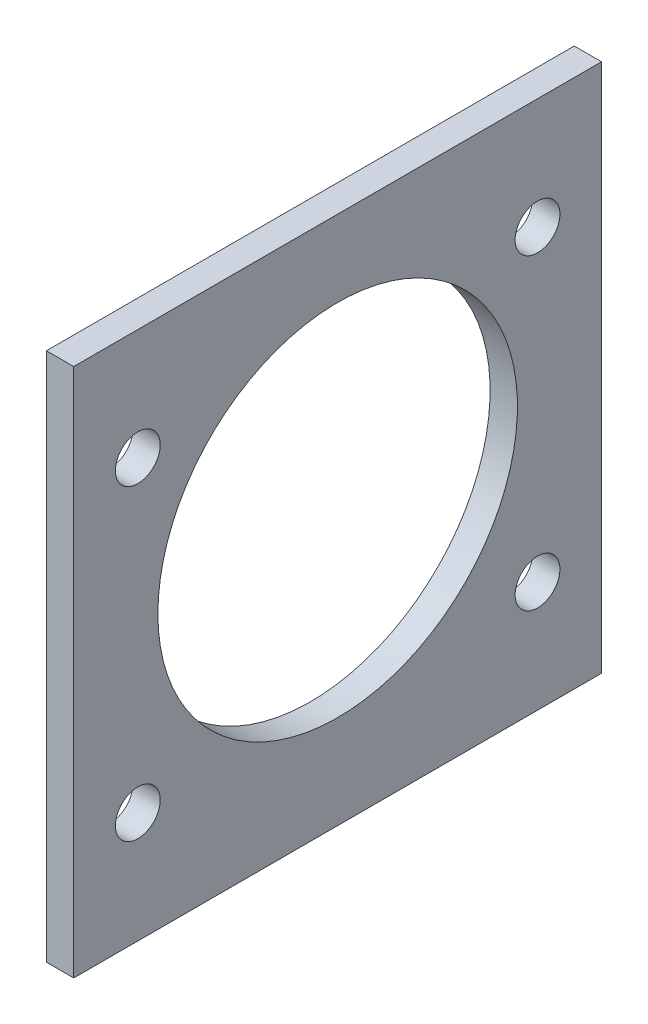
ISO-10303-21;
HEADER;
FILE_DESCRIPTION(('STEP AP214'),'2;1');
FILE_NAME('part.step','',(''),(''),'','','');
FILE_SCHEMA(('AUTOMOTIVE_DESIGN { 1 0 10303 214 1 1 1 1 }'));
ENDSEC;
DATA;
#1=APPLICATION_CONTEXT('core data for automotive mechanical design processes');
#2=APPLICATION_PROTOCOL_DEFINITION('international standard','automotive_design',2000,#1);
#3=PRODUCT_CONTEXT('',#1,'mechanical');
#4=PRODUCT('Part','Part','',(#3));
#5=PRODUCT_RELATED_PRODUCT_CATEGORY('part','',(#4));
#6=PRODUCT_DEFINITION_FORMATION('','',#4);
#7=PRODUCT_DEFINITION_CONTEXT('part definition',#1,'design');
#8=PRODUCT_DEFINITION('design','',#6,#7);
#9=PRODUCT_DEFINITION_SHAPE('','',#8);
#10=(LENGTH_UNIT() NAMED_UNIT(*) SI_UNIT(.MILLI.,.METRE.));
#11=(NAMED_UNIT(*) PLANE_ANGLE_UNIT() SI_UNIT($,.RADIAN.));
#12=(NAMED_UNIT(*) SI_UNIT($,.STERADIAN.) SOLID_ANGLE_UNIT());
#13=UNCERTAINTY_MEASURE_WITH_UNIT(LENGTH_MEASURE(1.E-05),#10,'distance_accuracy_value','');
#14=(GEOMETRIC_REPRESENTATION_CONTEXT(3) GLOBAL_UNCERTAINTY_ASSIGNED_CONTEXT((#13)) GLOBAL_UNIT_ASSIGNED_CONTEXT((#10,
#11,#12)) REPRESENTATION_CONTEXT('',''));
#15=CARTESIAN_POINT('',(0.,0.,0.));
#16=DIRECTION('',(0.,0.,1.));
#17=DIRECTION('',(1.,0.,0.));
#18=AXIS2_PLACEMENT_3D('',#15,#16,#17);
#19=CARTESIAN_POINT('',(3.2,0.,0.));
#20=DIRECTION('',(0.,0.,-1.));
#21=DIRECTION('',(-1.,0.,0.));
#22=AXIS2_PLACEMENT_3D('',#19,#20,#21);
#23=PLANE('',#22);
#24=DIRECTION('',(0.,-1.,0.));
#25=VECTOR('',#24,1.);
#26=CARTESIAN_POINT('',(0.,0.,0.));
#27=LINE('',#26,#25);
#28=CARTESIAN_POINT('',(0.,62.,0.));
#29=VERTEX_POINT('',#28);
#30=CARTESIAN_POINT('',(0.,0.,0.));
#31=VERTEX_POINT('',#30);
#32=EDGE_CURVE('E96',#29,#31,#27,.T.);
#33=ORIENTED_EDGE('',*,*,#32,.T.);
#34=DIRECTION('',(-1.,0.,0.));
#35=VECTOR('',#34,1.);
#36=CARTESIAN_POINT('',(3.2,0.,0.));
#37=LINE('',#36,#35);
#38=CARTESIAN_POINT('',(3.2,0.,0.));
#39=VERTEX_POINT('',#38);
#40=EDGE_CURVE('E11',#39,#31,#37,.T.);
#41=ORIENTED_EDGE('',*,*,#40,.F.);
#42=DIRECTION('',(0.,-1.,0.));
#43=VECTOR('',#42,1.);
#44=CARTESIAN_POINT('',(3.2,0.,0.));
#45=LINE('',#44,#43);
#46=CARTESIAN_POINT('',(3.2,62.,0.));
#47=VERTEX_POINT('',#46);
#48=EDGE_CURVE('E84',#47,#39,#45,.T.);
#49=ORIENTED_EDGE('',*,*,#48,.F.);
#50=DIRECTION('',(-1.,0.,0.));
#51=VECTOR('',#50,1.);
#52=CARTESIAN_POINT('',(3.2,62.,0.));
#53=LINE('',#52,#51);
#54=EDGE_CURVE('E92',#47,#29,#53,.T.);
#55=ORIENTED_EDGE('',*,*,#54,.T.);
#56=EDGE_LOOP('',(#33,#41,#49,#55));
#57=FACE_BOUND('',#56,.T.);
#58=ADVANCED_FACE('F33',(#57),#23,.F.);
#59=CARTESIAN_POINT('',(3.2,0.,0.));
#60=DIRECTION('',(0.,1.,0.));
#61=DIRECTION('',(0.,0.,1.));
#62=AXIS2_PLACEMENT_3D('',#59,#60,#61);
#63=PLANE('',#62);
#64=DIRECTION('',(0.,0.,-1.));
#65=VECTOR('',#64,1.);
#66=CARTESIAN_POINT('',(0.,0.,0.));
#67=LINE('',#66,#65);
#68=CARTESIAN_POINT('',(0.,0.,-61.8));
#69=VERTEX_POINT('',#68);
#70=EDGE_CURVE('E88',#31,#69,#67,.T.);
#71=ORIENTED_EDGE('',*,*,#70,.T.);
#72=DIRECTION('',(-1.,0.,0.));
#73=VECTOR('',#72,1.);
#74=CARTESIAN_POINT('',(3.2,0.,-61.8));
#75=LINE('',#74,#73);
#76=CARTESIAN_POINT('',(3.2,0.,-61.8));
#77=VERTEX_POINT('',#76);
#78=EDGE_CURVE('E41',#77,#69,#75,.T.);
#79=ORIENTED_EDGE('',*,*,#78,.F.);
#80=DIRECTION('',(0.,0.,-1.));
#81=VECTOR('',#80,1.);
#82=CARTESIAN_POINT('',(3.2,0.,0.));
#83=LINE('',#82,#81);
#84=EDGE_CURVE('E79',#39,#77,#83,.T.);
#85=ORIENTED_EDGE('',*,*,#84,.F.);
#86=ORIENTED_EDGE('',*,*,#40,.T.);
#87=EDGE_LOOP('',(#71,#79,#85,#86));
#88=FACE_BOUND('',#87,.T.);
#89=ADVANCED_FACE('F87',(#88),#63,.F.);
#90=CARTESIAN_POINT('',(3.2,0.,-61.8));
#91=DIRECTION('',(0.,0.,1.));
#92=DIRECTION('',(1.,0.,0.));
#93=AXIS2_PLACEMENT_3D('',#90,#91,#92);
#94=PLANE('',#93);
#95=DIRECTION('',(0.,1.,0.));
#96=VECTOR('',#95,1.);
#97=CARTESIAN_POINT('',(0.,0.,-61.8));
#98=LINE('',#97,#96);
#99=CARTESIAN_POINT('',(0.,62.,-61.8));
#100=VERTEX_POINT('',#99);
#101=EDGE_CURVE('E66',#69,#100,#98,.T.);
#102=ORIENTED_EDGE('',*,*,#101,.T.);
#103=DIRECTION('',(-1.,0.,0.));
#104=VECTOR('',#103,1.);
#105=CARTESIAN_POINT('',(3.2,62.,-61.8));
#106=LINE('',#105,#104);
#107=CARTESIAN_POINT('',(3.2,62.,-61.8));
#108=VERTEX_POINT('',#107);
#109=EDGE_CURVE('E89',#108,#100,#106,.T.);
#110=ORIENTED_EDGE('',*,*,#109,.F.);
#111=DIRECTION('',(0.,1.,0.));
#112=VECTOR('',#111,1.);
#113=CARTESIAN_POINT('',(3.2,0.,-61.8));
#114=LINE('',#113,#112);
#115=EDGE_CURVE('E82',#77,#108,#114,.T.);
#116=ORIENTED_EDGE('',*,*,#115,.F.);
#117=ORIENTED_EDGE('',*,*,#78,.T.);
#118=EDGE_LOOP('',(#102,#110,#116,#117));
#119=FACE_BOUND('',#118,.T.);
#120=ADVANCED_FACE('F90',(#119),#94,.F.);
#121=CARTESIAN_POINT('',(3.2,62.,0.));
#122=DIRECTION('',(0.,-1.,0.));
#123=DIRECTION('',(0.,0.,-1.));
#124=AXIS2_PLACEMENT_3D('',#121,#122,#123);
#125=PLANE('',#124);
#126=DIRECTION('',(0.,0.,1.));
#127=VECTOR('',#126,1.);
#128=CARTESIAN_POINT('',(0.,62.,0.));
#129=LINE('',#128,#127);
#130=EDGE_CURVE('E72',#100,#29,#129,.T.);
#131=ORIENTED_EDGE('',*,*,#130,.T.);
#132=ORIENTED_EDGE('',*,*,#54,.F.);
#133=DIRECTION('',(0.,0.,1.));
#134=VECTOR('',#133,1.);
#135=CARTESIAN_POINT('',(3.2,62.,0.));
#136=LINE('',#135,#134);
#137=EDGE_CURVE('E49',#108,#47,#136,.T.);
#138=ORIENTED_EDGE('',*,*,#137,.F.);
#139=ORIENTED_EDGE('',*,*,#109,.T.);
#140=EDGE_LOOP('',(#131,#132,#138,#139));
#141=FACE_BOUND('',#140,.T.);
#142=ADVANCED_FACE('F104',(#141),#125,.F.);
#143=CARTESIAN_POINT('',(3.2,0.,0.));
#144=DIRECTION('',(-1.,0.,0.));
#145=DIRECTION('',(0.,0.,1.));
#146=AXIS2_PLACEMENT_3D('',#143,#144,#145);
#147=PLANE('',#146);
#148=CARTESIAN_POINT('',(3.2,13.0000000000018,-7.50000000000057));
#149=DIRECTION('',(-1.,0.,0.));
#150=DIRECTION('',(0.,0.,1.));
#151=AXIS2_PLACEMENT_3D('',#148,#149,#150);
#152=CIRCLE('',#151,2.62500000000022);
#153=CARTESIAN_POINT('',(3.2,13.0000000000018,-4.87500000000035));
#154=VERTEX_POINT('',#153);
#155=EDGE_CURVE('E133',#154,#154,#152,.F.);
#156=ORIENTED_EDGE('',*,*,#155,.F.);
#157=EDGE_LOOP('',(#156));
#158=FACE_BOUND('',#157,.T.);
#159=CARTESIAN_POINT('',(3.2,49.0000000000018,-7.50000000000066));
#160=DIRECTION('',(-1.,0.,0.));
#161=DIRECTION('',(0.,0.,1.));
#162=AXIS2_PLACEMENT_3D('',#159,#160,#161);
#163=CIRCLE('',#162,2.625);
#164=CARTESIAN_POINT('',(3.2,49.0000000000018,-4.87500000000066));
#165=VERTEX_POINT('',#164);
#166=EDGE_CURVE('E127',#165,#165,#163,.F.);
#167=ORIENTED_EDGE('',*,*,#166,.F.);
#168=EDGE_LOOP('',(#167));
#169=FACE_BOUND('',#168,.T.);
#170=CARTESIAN_POINT('',(3.2,13.0000000000005,-54.3000000000008));
#171=DIRECTION('',(-1.,0.,0.));
#172=DIRECTION('',(0.,0.,1.));
#173=AXIS2_PLACEMENT_3D('',#170,#171,#172);
#174=CIRCLE('',#173,2.62499999999999);
#175=CARTESIAN_POINT('',(3.2,13.0000000000005,-51.6750000000008));
#176=VERTEX_POINT('',#175);
#177=EDGE_CURVE('E121',#176,#176,#174,.F.);
#178=ORIENTED_EDGE('',*,*,#177,.F.);
#179=EDGE_LOOP('',(#178));
#180=FACE_BOUND('',#179,.T.);
#181=CARTESIAN_POINT('',(3.2,49.0000000000005,-54.3000000000008));
#182=DIRECTION('',(-1.,0.,0.));
#183=DIRECTION('',(0.,0.,1.));
#184=AXIS2_PLACEMENT_3D('',#181,#182,#183);
#185=CIRCLE('',#184,2.625);
#186=CARTESIAN_POINT('',(3.2,49.0000000000005,-51.6750000000008));
#187=VERTEX_POINT('',#186);
#188=EDGE_CURVE('E113',#187,#187,#185,.F.);
#189=ORIENTED_EDGE('',*,*,#188,.F.);
#190=EDGE_LOOP('',(#189));
#191=FACE_BOUND('',#190,.T.);
#192=CARTESIAN_POINT('',(3.2,32.,-30.9));
#193=DIRECTION('',(1.,0.,0.));
#194=DIRECTION('',(0.,0.,1.));
#195=AXIS2_PLACEMENT_3D('',#192,#193,#194);
#196=CIRCLE('',#195,21.05);
#197=CARTESIAN_POINT('',(3.2,32.,-9.85000000000001));
#198=VERTEX_POINT('',#197);
#199=EDGE_CURVE('E99',#198,#198,#196,.T.);
#200=ORIENTED_EDGE('',*,*,#199,.F.);
#201=EDGE_LOOP('',(#200));
#202=FACE_BOUND('',#201,.T.);
#203=ORIENTED_EDGE('',*,*,#48,.T.);
#204=ORIENTED_EDGE('',*,*,#84,.T.);
#205=ORIENTED_EDGE('',*,*,#115,.T.);
#206=ORIENTED_EDGE('',*,*,#137,.T.);
#207=EDGE_LOOP('',(#203,#204,#205,#206));
#208=FACE_BOUND('',#207,.T.);
#209=ADVANCED_FACE('F80',(#158,#169,#180,#191,#202,#208),#147,.F.);
#210=CARTESIAN_POINT('',(0.,0.,0.));
#211=DIRECTION('',(-1.,0.,0.));
#212=DIRECTION('',(0.,0.,1.));
#213=AXIS2_PLACEMENT_3D('',#210,#211,#212);
#214=PLANE('',#213);
#215=CARTESIAN_POINT('',(0.,13.0000000000018,-7.50000000000057));
#216=DIRECTION('',(-1.,0.,0.));
#217=DIRECTION('',(0.,0.,1.));
#218=AXIS2_PLACEMENT_3D('',#215,#216,#217);
#219=CIRCLE('',#218,2.62500000000022);
#220=CARTESIAN_POINT('',(0.,13.0000000000018,-4.87500000000035));
#221=VERTEX_POINT('',#220);
#222=EDGE_CURVE('E136',#221,#221,#219,.T.);
#223=ORIENTED_EDGE('',*,*,#222,.F.);
#224=EDGE_LOOP('',(#223));
#225=FACE_BOUND('',#224,.T.);
#226=CARTESIAN_POINT('',(0.,49.0000000000018,-7.50000000000066));
#227=DIRECTION('',(-1.,0.,0.));
#228=DIRECTION('',(0.,0.,1.));
#229=AXIS2_PLACEMENT_3D('',#226,#227,#228);
#230=CIRCLE('',#229,2.625);
#231=CARTESIAN_POINT('',(0.,49.0000000000018,-4.87500000000066));
#232=VERTEX_POINT('',#231);
#233=EDGE_CURVE('E130',#232,#232,#230,.T.);
#234=ORIENTED_EDGE('',*,*,#233,.F.);
#235=EDGE_LOOP('',(#234));
#236=FACE_BOUND('',#235,.T.);
#237=CARTESIAN_POINT('',(0.,13.0000000000005,-54.3000000000008));
#238=DIRECTION('',(-1.,0.,0.));
#239=DIRECTION('',(0.,0.,1.));
#240=AXIS2_PLACEMENT_3D('',#237,#238,#239);
#241=CIRCLE('',#240,2.62499999999999);
#242=CARTESIAN_POINT('',(0.,13.0000000000005,-51.6750000000008));
#243=VERTEX_POINT('',#242);
#244=EDGE_CURVE('E124',#243,#243,#241,.T.);
#245=ORIENTED_EDGE('',*,*,#244,.F.);
#246=EDGE_LOOP('',(#245));
#247=FACE_BOUND('',#246,.T.);
#248=CARTESIAN_POINT('',(0.,49.0000000000005,-54.3000000000008));
#249=DIRECTION('',(-1.,0.,0.));
#250=DIRECTION('',(0.,0.,1.));
#251=AXIS2_PLACEMENT_3D('',#248,#249,#250);
#252=CIRCLE('',#251,2.625);
#253=CARTESIAN_POINT('',(0.,49.0000000000005,-51.6750000000008));
#254=VERTEX_POINT('',#253);
#255=EDGE_CURVE('E118',#254,#254,#252,.T.);
#256=ORIENTED_EDGE('',*,*,#255,.F.);
#257=EDGE_LOOP('',(#256));
#258=FACE_BOUND('',#257,.T.);
#259=CARTESIAN_POINT('',(0.,32.,-30.9));
#260=DIRECTION('',(-1.,0.,0.));
#261=DIRECTION('',(0.,0.,1.));
#262=AXIS2_PLACEMENT_3D('',#259,#260,#261);
#263=CIRCLE('',#262,21.05);
#264=CARTESIAN_POINT('',(0.,32.,-9.85000000000001));
#265=VERTEX_POINT('',#264);
#266=EDGE_CURVE('E110',#265,#265,#263,.F.);
#267=ORIENTED_EDGE('',*,*,#266,.T.);
#268=EDGE_LOOP('',(#267));
#269=FACE_BOUND('',#268,.T.);
#270=ORIENTED_EDGE('',*,*,#32,.F.);
#271=ORIENTED_EDGE('',*,*,#130,.F.);
#272=ORIENTED_EDGE('',*,*,#101,.F.);
#273=ORIENTED_EDGE('',*,*,#70,.F.);
#274=EDGE_LOOP('',(#270,#271,#272,#273));
#275=FACE_BOUND('',#274,.T.);
#276=ADVANCED_FACE('F107',(#225,#236,#247,#258,#269,#275),#214,.T.);
#277=CARTESIAN_POINT('',(-0.00100000000000013,32.,-30.9));
#278=DIRECTION('',(1.,0.,0.));
#279=DIRECTION('',(0.,0.,-1.));
#280=AXIS2_PLACEMENT_3D('',#277,#278,#279);
#281=CYLINDRICAL_SURFACE('',#280,21.05);
#282=ORIENTED_EDGE('',*,*,#266,.F.);
#283=EDGE_LOOP('',(#282));
#284=FACE_BOUND('',#283,.T.);
#285=ORIENTED_EDGE('',*,*,#199,.T.);
#286=EDGE_LOOP('',(#285));
#287=FACE_BOUND('',#286,.T.);
#288=ADVANCED_FACE('F145',(#284,#287),#281,.F.);
#289=CARTESIAN_POINT('',(3.201,49.0000000000005,-54.3000000000008));
#290=DIRECTION('',(-1.,0.,0.));
#291=DIRECTION('',(0.,0.,1.));
#292=AXIS2_PLACEMENT_3D('',#289,#290,#291);
#293=CYLINDRICAL_SURFACE('',#292,2.625);
#294=ORIENTED_EDGE('',*,*,#255,.T.);
#295=EDGE_LOOP('',(#294));
#296=FACE_BOUND('',#295,.T.);
#297=ORIENTED_EDGE('',*,*,#188,.T.);
#298=EDGE_LOOP('',(#297));
#299=FACE_BOUND('',#298,.T.);
#300=ADVANCED_FACE('F157',(#296,#299),#293,.F.);
#301=CARTESIAN_POINT('',(3.201,13.0000000000005,-54.3000000000008));
#302=DIRECTION('',(-1.,0.,0.));
#303=DIRECTION('',(0.,0.,1.));
#304=AXIS2_PLACEMENT_3D('',#301,#302,#303);
#305=CYLINDRICAL_SURFACE('',#304,2.62499999999999);
#306=ORIENTED_EDGE('',*,*,#244,.T.);
#307=EDGE_LOOP('',(#306));
#308=FACE_BOUND('',#307,.T.);
#309=ORIENTED_EDGE('',*,*,#177,.T.);
#310=EDGE_LOOP('',(#309));
#311=FACE_BOUND('',#310,.T.);
#312=ADVANCED_FACE('F209',(#308,#311),#305,.F.);
#313=CARTESIAN_POINT('',(3.201,49.0000000000018,-7.50000000000066));
#314=DIRECTION('',(-1.,0.,0.));
#315=DIRECTION('',(0.,0.,1.));
#316=AXIS2_PLACEMENT_3D('',#313,#314,#315);
#317=CYLINDRICAL_SURFACE('',#316,2.625);
#318=ORIENTED_EDGE('',*,*,#233,.T.);
#319=EDGE_LOOP('',(#318));
#320=FACE_BOUND('',#319,.T.);
#321=ORIENTED_EDGE('',*,*,#166,.T.);
#322=EDGE_LOOP('',(#321));
#323=FACE_BOUND('',#322,.T.);
#324=ADVANCED_FACE('F219',(#320,#323),#317,.F.);
#325=CARTESIAN_POINT('',(3.201,13.0000000000018,-7.50000000000057));
#326=DIRECTION('',(-1.,0.,0.));
#327=DIRECTION('',(0.,0.,1.));
#328=AXIS2_PLACEMENT_3D('',#325,#326,#327);
#329=CYLINDRICAL_SURFACE('',#328,2.62500000000022);
#330=ORIENTED_EDGE('',*,*,#222,.T.);
#331=EDGE_LOOP('',(#330));
#332=FACE_BOUND('',#331,.T.);
#333=ORIENTED_EDGE('',*,*,#155,.T.);
#334=EDGE_LOOP('',(#333));
#335=FACE_BOUND('',#334,.T.);
#336=ADVANCED_FACE('F140',(#332,#335),#329,.F.);
#337=CLOSED_SHELL('',(#58,#89,#120,#142,#209,#276,#288,#300,#312,#324,#336));
#338=MANIFOLD_SOLID_BREP('B2',#337);
#339=ADVANCED_BREP_SHAPE_REPRESENTATION('',(#18,#338),#14);
#340=SHAPE_DEFINITION_REPRESENTATION(#9,#339);
ENDSEC;
END-ISO-10303-21;
